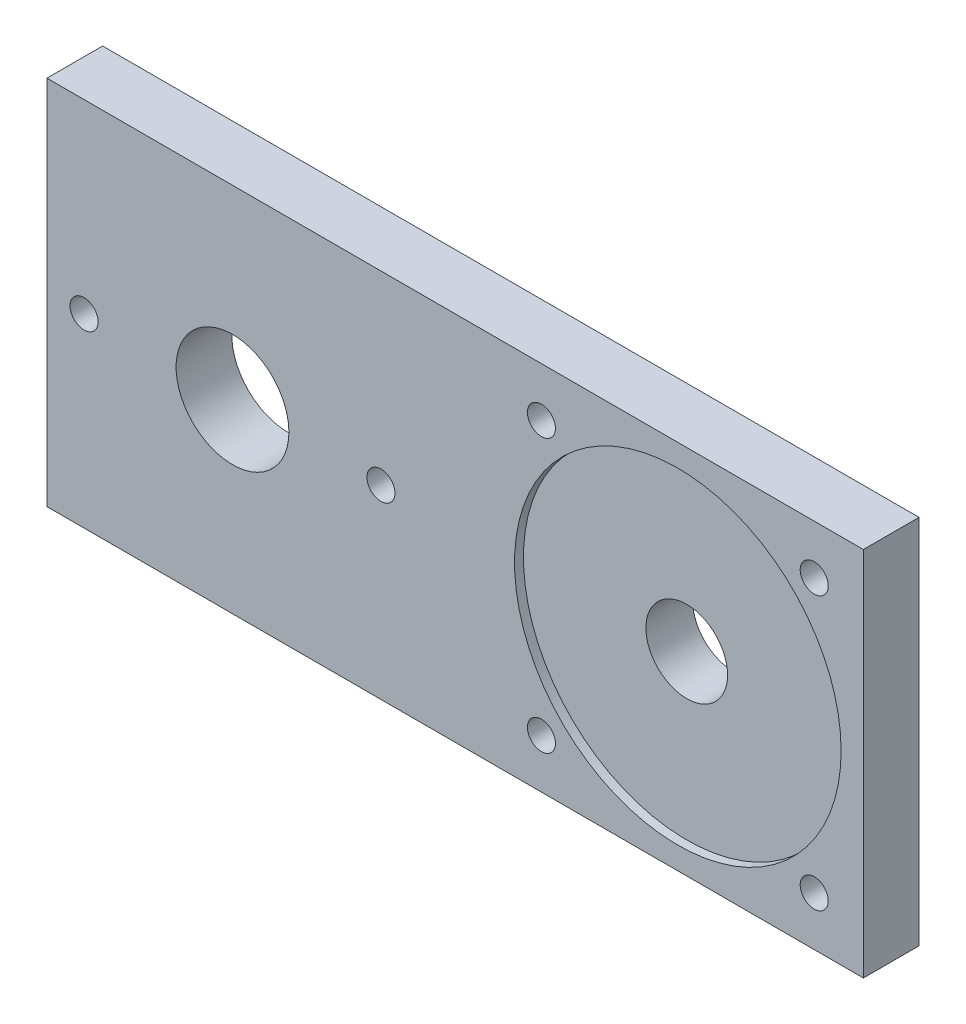
ISO-10303-21;
HEADER;
FILE_DESCRIPTION(('STEP AP214'),'2;1');
FILE_NAME('part.step','',(''),(''),'','','');
FILE_SCHEMA(('AUTOMOTIVE_DESIGN { 1 0 10303 214 1 1 1 1 }'));
ENDSEC;
DATA;
#1=APPLICATION_CONTEXT('core data for automotive mechanical design processes');
#2=APPLICATION_PROTOCOL_DEFINITION('international standard','automotive_design',2000,#1);
#3=PRODUCT_CONTEXT('',#1,'mechanical');
#4=PRODUCT('Part','Part','',(#3));
#5=PRODUCT_RELATED_PRODUCT_CATEGORY('part','',(#4));
#6=PRODUCT_DEFINITION_FORMATION('','',#4);
#7=PRODUCT_DEFINITION_CONTEXT('part definition',#1,'design');
#8=PRODUCT_DEFINITION('design','',#6,#7);
#9=PRODUCT_DEFINITION_SHAPE('','',#8);
#10=(LENGTH_UNIT() NAMED_UNIT(*) SI_UNIT(.MILLI.,.METRE.));
#11=(NAMED_UNIT(*) PLANE_ANGLE_UNIT() SI_UNIT($,.RADIAN.));
#12=(NAMED_UNIT(*) SI_UNIT($,.STERADIAN.) SOLID_ANGLE_UNIT());
#13=UNCERTAINTY_MEASURE_WITH_UNIT(LENGTH_MEASURE(1.E-05),#10,'distance_accuracy_value','');
#14=(GEOMETRIC_REPRESENTATION_CONTEXT(3) GLOBAL_UNCERTAINTY_ASSIGNED_CONTEXT((#13)) GLOBAL_UNIT_ASSIGNED_CONTEXT((#10,
#11,#12)) REPRESENTATION_CONTEXT('',''));
#15=CARTESIAN_POINT('',(0.,0.,0.));
#16=DIRECTION('',(0.,0.,1.));
#17=DIRECTION('',(1.,0.,0.));
#18=AXIS2_PLACEMENT_3D('',#15,#16,#17);
#19=CARTESIAN_POINT('',(0.,0.,9.525));
#20=DIRECTION('',(0.,0.,-1.));
#21=DIRECTION('',(-1.,0.,0.));
#22=AXIS2_PLACEMENT_3D('',#19,#20,#21);
#23=PLANE('',#22);
#24=CARTESIAN_POINT('',(38.1,38.1,9.525));
#25=DIRECTION('',(0.,0.,1.));
#26=DIRECTION('',(1.,0.,0.));
#27=AXIS2_PLACEMENT_3D('',#24,#25,#26);
#28=CIRCLE('',#27,9.65199999999999);
#29=CARTESIAN_POINT('',(47.752,38.1,9.525));
#30=VERTEX_POINT('',#29);
#31=EDGE_CURVE('E42',#30,#30,#28,.T.);
#32=ORIENTED_EDGE('',*,*,#31,.F.);
#33=EDGE_LOOP('',(#32));
#34=FACE_BOUND('',#33,.T.);
#35=CARTESIAN_POINT('',(12.7,38.1,9.525));
#36=DIRECTION('',(0.,0.,1.));
#37=DIRECTION('',(1.,0.,0.));
#38=AXIS2_PLACEMENT_3D('',#35,#36,#37);
#39=CIRCLE('',#38,2.40029999999999);
#40=CARTESIAN_POINT('',(15.1003,38.1,9.525));
#41=VERTEX_POINT('',#40);
#42=EDGE_CURVE('E146',#41,#41,#39,.T.);
#43=ORIENTED_EDGE('',*,*,#42,.F.);
#44=EDGE_LOOP('',(#43));
#45=FACE_BOUND('',#44,.T.);
#46=CARTESIAN_POINT('',(63.5,38.1,9.525));
#47=DIRECTION('',(0.,0.,1.));
#48=DIRECTION('',(1.,0.,0.));
#49=AXIS2_PLACEMENT_3D('',#46,#47,#48);
#50=CIRCLE('',#49,2.40029999999999);
#51=CARTESIAN_POINT('',(65.9003,38.1,9.525));
#52=VERTEX_POINT('',#51);
#53=EDGE_CURVE('E118',#52,#52,#50,.T.);
#54=ORIENTED_EDGE('',*,*,#53,.F.);
#55=EDGE_LOOP('',(#54));
#56=FACE_BOUND('',#55,.T.);
#57=CARTESIAN_POINT('',(90.95994,61.44006,9.525));
#58=DIRECTION('',(0.,0.,1.));
#59=DIRECTION('',(1.,0.,0.));
#60=AXIS2_PLACEMENT_3D('',#57,#58,#59);
#61=CIRCLE('',#60,2.40029999999999);
#62=CARTESIAN_POINT('',(93.36024,61.44006,9.525));
#63=VERTEX_POINT('',#62);
#64=EDGE_CURVE('E119',#63,#63,#61,.T.);
#65=ORIENTED_EDGE('',*,*,#64,.F.);
#66=EDGE_LOOP('',(#65));
#67=FACE_BOUND('',#66,.T.);
#68=CARTESIAN_POINT('',(137.64006,61.44006,9.525));
#69=DIRECTION('',(0.,0.,1.));
#70=DIRECTION('',(1.,0.,0.));
#71=AXIS2_PLACEMENT_3D('',#68,#69,#70);
#72=CIRCLE('',#71,2.40029999999999);
#73=CARTESIAN_POINT('',(140.04036,61.44006,9.525));
#74=VERTEX_POINT('',#73);
#75=EDGE_CURVE('E125',#74,#74,#72,.T.);
#76=ORIENTED_EDGE('',*,*,#75,.F.);
#77=EDGE_LOOP('',(#76));
#78=FACE_BOUND('',#77,.T.);
#79=CARTESIAN_POINT('',(90.95994,14.75994,9.525));
#80=DIRECTION('',(0.,0.,1.));
#81=DIRECTION('',(1.,0.,0.));
#82=AXIS2_PLACEMENT_3D('',#79,#80,#81);
#83=CIRCLE('',#82,2.40029999999999);
#84=CARTESIAN_POINT('',(93.36024,14.75994,9.525));
#85=VERTEX_POINT('',#84);
#86=EDGE_CURVE('E131',#85,#85,#83,.T.);
#87=ORIENTED_EDGE('',*,*,#86,.F.);
#88=EDGE_LOOP('',(#87));
#89=FACE_BOUND('',#88,.T.);
#90=CARTESIAN_POINT('',(137.64006,14.75994,9.525));
#91=DIRECTION('',(0.,0.,1.));
#92=DIRECTION('',(1.,0.,0.));
#93=AXIS2_PLACEMENT_3D('',#90,#91,#92);
#94=CIRCLE('',#93,2.40029999999999);
#95=CARTESIAN_POINT('',(140.04036,14.75994,9.525));
#96=VERTEX_POINT('',#95);
#97=EDGE_CURVE('E137',#96,#96,#94,.T.);
#98=ORIENTED_EDGE('',*,*,#97,.F.);
#99=EDGE_LOOP('',(#98));
#100=FACE_BOUND('',#99,.T.);
#101=CARTESIAN_POINT('',(114.3,38.1,9.525));
#102=DIRECTION('',(0.,0.,1.));
#103=DIRECTION('',(1.,0.,0.));
#104=AXIS2_PLACEMENT_3D('',#101,#102,#103);
#105=CIRCLE('',#104,27.94);
#106=CARTESIAN_POINT('',(142.24,38.1,9.525));
#107=VERTEX_POINT('',#106);
#108=EDGE_CURVE('E107',#107,#107,#105,.T.);
#109=ORIENTED_EDGE('',*,*,#108,.F.);
#110=EDGE_LOOP('',(#109));
#111=FACE_BOUND('',#110,.T.);
#112=DIRECTION('',(1.,0.,0.));
#113=VECTOR('',#112,1.);
#114=CARTESIAN_POINT('',(146.05,69.85,9.525));
#115=LINE('',#114,#113);
#116=CARTESIAN_POINT('',(6.34999999999999,69.85,9.525));
#117=VERTEX_POINT('',#116);
#118=CARTESIAN_POINT('',(146.05,69.85,9.525));
#119=VERTEX_POINT('',#118);
#120=EDGE_CURVE('E50',#117,#119,#115,.T.);
#121=ORIENTED_EDGE('',*,*,#120,.F.);
#122=DIRECTION('',(0.,1.,0.));
#123=VECTOR('',#122,1.);
#124=CARTESIAN_POINT('',(6.34999999999999,69.85,9.525));
#125=LINE('',#124,#123);
#126=CARTESIAN_POINT('',(6.35,6.34999999999999,9.525));
#127=VERTEX_POINT('',#126);
#128=EDGE_CURVE('E80',#127,#117,#125,.T.);
#129=ORIENTED_EDGE('',*,*,#128,.F.);
#130=DIRECTION('',(-1.,0.,0.));
#131=VECTOR('',#130,1.);
#132=CARTESIAN_POINT('',(146.05,6.35,9.525));
#133=LINE('',#132,#131);
#134=CARTESIAN_POINT('',(146.05,6.35,9.525));
#135=VERTEX_POINT('',#134);
#136=EDGE_CURVE('E87',#135,#127,#133,.T.);
#137=ORIENTED_EDGE('',*,*,#136,.F.);
#138=DIRECTION('',(0.,-1.,0.));
#139=VECTOR('',#138,1.);
#140=CARTESIAN_POINT('',(146.05,69.85,9.525));
#141=LINE('',#140,#139);
#142=EDGE_CURVE('E92',#119,#135,#141,.T.);
#143=ORIENTED_EDGE('',*,*,#142,.F.);
#144=EDGE_LOOP('',(#121,#129,#137,#143));
#145=FACE_BOUND('',#144,.T.);
#146=ADVANCED_FACE('F33',(#34,#45,#56,#67,#78,#89,#100,#111,#145),#23,.F.);
#147=CARTESIAN_POINT('',(0.,0.,0.));
#148=DIRECTION('',(0.,0.,-1.));
#149=DIRECTION('',(-1.,0.,0.));
#150=AXIS2_PLACEMENT_3D('',#147,#148,#149);
#151=PLANE('',#150);
#152=CARTESIAN_POINT('',(38.1,38.1,0.));
#153=DIRECTION('',(0.,0.,1.));
#154=DIRECTION('',(1.,0.,0.));
#155=AXIS2_PLACEMENT_3D('',#152,#153,#154);
#156=CIRCLE('',#155,9.65199999999999);
#157=CARTESIAN_POINT('',(47.752,38.1,0.));
#158=VERTEX_POINT('',#157);
#159=EDGE_CURVE('E11',#158,#158,#156,.T.);
#160=ORIENTED_EDGE('',*,*,#159,.T.);
#161=EDGE_LOOP('',(#160));
#162=FACE_BOUND('',#161,.T.);
#163=CARTESIAN_POINT('',(114.3,38.1,0.));
#164=DIRECTION('',(0.,0.,1.));
#165=DIRECTION('',(1.,0.,0.));
#166=AXIS2_PLACEMENT_3D('',#163,#164,#165);
#167=CIRCLE('',#166,6.98500000000001);
#168=CARTESIAN_POINT('',(121.285,38.1,0.));
#169=VERTEX_POINT('',#168);
#170=EDGE_CURVE('E140',#169,#169,#167,.T.);
#171=ORIENTED_EDGE('',*,*,#170,.T.);
#172=EDGE_LOOP('',(#171));
#173=FACE_BOUND('',#172,.T.);
#174=CARTESIAN_POINT('',(12.7,38.1,0.));
#175=DIRECTION('',(0.,0.,1.));
#176=DIRECTION('',(1.,0.,0.));
#177=AXIS2_PLACEMENT_3D('',#174,#175,#176);
#178=CIRCLE('',#177,2.40029999999999);
#179=CARTESIAN_POINT('',(15.1003,38.1,0.));
#180=VERTEX_POINT('',#179);
#181=EDGE_CURVE('E143',#180,#180,#178,.T.);
#182=ORIENTED_EDGE('',*,*,#181,.T.);
#183=EDGE_LOOP('',(#182));
#184=FACE_BOUND('',#183,.T.);
#185=CARTESIAN_POINT('',(63.5,38.1,0.));
#186=DIRECTION('',(0.,0.,1.));
#187=DIRECTION('',(1.,0.,0.));
#188=AXIS2_PLACEMENT_3D('',#185,#186,#187);
#189=CIRCLE('',#188,2.40029999999999);
#190=CARTESIAN_POINT('',(65.9003,38.1,0.));
#191=VERTEX_POINT('',#190);
#192=EDGE_CURVE('E149',#191,#191,#189,.T.);
#193=ORIENTED_EDGE('',*,*,#192,.T.);
#194=EDGE_LOOP('',(#193));
#195=FACE_BOUND('',#194,.T.);
#196=CARTESIAN_POINT('',(90.95994,61.44006,0.));
#197=DIRECTION('',(0.,0.,1.));
#198=DIRECTION('',(1.,0.,0.));
#199=AXIS2_PLACEMENT_3D('',#196,#197,#198);
#200=CIRCLE('',#199,2.40029999999999);
#201=CARTESIAN_POINT('',(93.36024,61.44006,0.));
#202=VERTEX_POINT('',#201);
#203=EDGE_CURVE('E115',#202,#202,#200,.T.);
#204=ORIENTED_EDGE('',*,*,#203,.T.);
#205=EDGE_LOOP('',(#204));
#206=FACE_BOUND('',#205,.T.);
#207=CARTESIAN_POINT('',(137.64006,61.44006,0.));
#208=DIRECTION('',(0.,0.,1.));
#209=DIRECTION('',(1.,0.,0.));
#210=AXIS2_PLACEMENT_3D('',#207,#208,#209);
#211=CIRCLE('',#210,2.40029999999999);
#212=CARTESIAN_POINT('',(140.04036,61.44006,0.));
#213=VERTEX_POINT('',#212);
#214=EDGE_CURVE('E122',#213,#213,#211,.T.);
#215=ORIENTED_EDGE('',*,*,#214,.T.);
#216=EDGE_LOOP('',(#215));
#217=FACE_BOUND('',#216,.T.);
#218=CARTESIAN_POINT('',(90.95994,14.75994,0.));
#219=DIRECTION('',(0.,0.,1.));
#220=DIRECTION('',(1.,0.,0.));
#221=AXIS2_PLACEMENT_3D('',#218,#219,#220);
#222=CIRCLE('',#221,2.40029999999999);
#223=CARTESIAN_POINT('',(93.36024,14.75994,0.));
#224=VERTEX_POINT('',#223);
#225=EDGE_CURVE('E128',#224,#224,#222,.T.);
#226=ORIENTED_EDGE('',*,*,#225,.T.);
#227=EDGE_LOOP('',(#226));
#228=FACE_BOUND('',#227,.T.);
#229=CARTESIAN_POINT('',(137.64006,14.75994,0.));
#230=DIRECTION('',(0.,0.,1.));
#231=DIRECTION('',(1.,0.,0.));
#232=AXIS2_PLACEMENT_3D('',#229,#230,#231);
#233=CIRCLE('',#232,2.40029999999999);
#234=CARTESIAN_POINT('',(140.04036,14.75994,0.));
#235=VERTEX_POINT('',#234);
#236=EDGE_CURVE('E134',#235,#235,#233,.T.);
#237=ORIENTED_EDGE('',*,*,#236,.T.);
#238=EDGE_LOOP('',(#237));
#239=FACE_BOUND('',#238,.T.);
#240=DIRECTION('',(0.,1.,0.));
#241=VECTOR('',#240,1.);
#242=CARTESIAN_POINT('',(6.34999999999999,69.85,0.));
#243=LINE('',#242,#241);
#244=CARTESIAN_POINT('',(6.35,6.34999999999999,0.));
#245=VERTEX_POINT('',#244);
#246=CARTESIAN_POINT('',(6.34999999999999,69.85,0.));
#247=VERTEX_POINT('',#246);
#248=EDGE_CURVE('E82',#245,#247,#243,.T.);
#249=ORIENTED_EDGE('',*,*,#248,.T.);
#250=DIRECTION('',(1.,0.,0.));
#251=VECTOR('',#250,1.);
#252=CARTESIAN_POINT('',(146.05,69.85,0.));
#253=LINE('',#252,#251);
#254=CARTESIAN_POINT('',(146.05,69.85,0.));
#255=VERTEX_POINT('',#254);
#256=EDGE_CURVE('E99',#247,#255,#253,.T.);
#257=ORIENTED_EDGE('',*,*,#256,.T.);
#258=DIRECTION('',(0.,-1.,0.));
#259=VECTOR('',#258,1.);
#260=CARTESIAN_POINT('',(146.05,69.85,0.));
#261=LINE('',#260,#259);
#262=CARTESIAN_POINT('',(146.05,6.35,0.));
#263=VERTEX_POINT('',#262);
#264=EDGE_CURVE('E102',#255,#263,#261,.T.);
#265=ORIENTED_EDGE('',*,*,#264,.T.);
#266=DIRECTION('',(-1.,0.,0.));
#267=VECTOR('',#266,1.);
#268=CARTESIAN_POINT('',(146.05,6.35,0.));
#269=LINE('',#268,#267);
#270=EDGE_CURVE('E58',#263,#245,#269,.T.);
#271=ORIENTED_EDGE('',*,*,#270,.T.);
#272=EDGE_LOOP('',(#249,#257,#265,#271));
#273=FACE_BOUND('',#272,.T.);
#274=ADVANCED_FACE('F35',(#162,#173,#184,#195,#206,#217,#228,#239,#273),#151,.T.);
#275=CARTESIAN_POINT('',(114.3,38.1,0.));
#276=DIRECTION('',(0.,0.,1.));
#277=DIRECTION('',(1.,0.,0.));
#278=AXIS2_PLACEMENT_3D('',#275,#276,#277);
#279=CYLINDRICAL_SURFACE('',#278,6.98500000000001);
#280=ORIENTED_EDGE('',*,*,#170,.F.);
#281=EDGE_LOOP('',(#280));
#282=FACE_BOUND('',#281,.T.);
#283=CARTESIAN_POINT('',(114.3,38.1,8.001));
#284=DIRECTION('',(0.,0.,1.));
#285=DIRECTION('',(1.,0.,0.));
#286=AXIS2_PLACEMENT_3D('',#283,#284,#285);
#287=CIRCLE('',#286,6.98500000000001);
#288=CARTESIAN_POINT('',(121.285,38.1,8.001));
#289=VERTEX_POINT('',#288);
#290=EDGE_CURVE('E37',#289,#289,#287,.F.);
#291=ORIENTED_EDGE('',*,*,#290,.F.);
#292=EDGE_LOOP('',(#291));
#293=FACE_BOUND('',#292,.T.);
#294=ADVANCED_FACE('F206',(#282,#293),#279,.F.);
#295=CARTESIAN_POINT('',(38.1,38.1,0.));
#296=DIRECTION('',(0.,0.,1.));
#297=DIRECTION('',(1.,0.,0.));
#298=AXIS2_PLACEMENT_3D('',#295,#296,#297);
#299=CYLINDRICAL_SURFACE('',#298,9.65199999999999);
#300=ORIENTED_EDGE('',*,*,#159,.F.);
#301=EDGE_LOOP('',(#300));
#302=FACE_BOUND('',#301,.T.);
#303=ORIENTED_EDGE('',*,*,#31,.T.);
#304=EDGE_LOOP('',(#303));
#305=FACE_BOUND('',#304,.T.);
#306=ADVANCED_FACE('F156',(#302,#305),#299,.F.);
#307=CARTESIAN_POINT('',(12.7,38.1,0.));
#308=DIRECTION('',(0.,0.,1.));
#309=DIRECTION('',(1.,0.,0.));
#310=AXIS2_PLACEMENT_3D('',#307,#308,#309);
#311=CYLINDRICAL_SURFACE('',#310,2.40029999999999);
#312=ORIENTED_EDGE('',*,*,#181,.F.);
#313=EDGE_LOOP('',(#312));
#314=FACE_BOUND('',#313,.T.);
#315=ORIENTED_EDGE('',*,*,#42,.T.);
#316=EDGE_LOOP('',(#315));
#317=FACE_BOUND('',#316,.T.);
#318=ADVANCED_FACE('F210',(#314,#317),#311,.F.);
#319=CARTESIAN_POINT('',(63.5,38.1,0.));
#320=DIRECTION('',(0.,0.,1.));
#321=DIRECTION('',(1.,0.,0.));
#322=AXIS2_PLACEMENT_3D('',#319,#320,#321);
#323=CYLINDRICAL_SURFACE('',#322,2.40029999999999);
#324=ORIENTED_EDGE('',*,*,#192,.F.);
#325=EDGE_LOOP('',(#324));
#326=FACE_BOUND('',#325,.T.);
#327=ORIENTED_EDGE('',*,*,#53,.T.);
#328=EDGE_LOOP('',(#327));
#329=FACE_BOUND('',#328,.T.);
#330=ADVANCED_FACE('F194',(#326,#329),#323,.F.);
#331=CARTESIAN_POINT('',(90.95994,61.44006,0.));
#332=DIRECTION('',(0.,0.,1.));
#333=DIRECTION('',(1.,0.,0.));
#334=AXIS2_PLACEMENT_3D('',#331,#332,#333);
#335=CYLINDRICAL_SURFACE('',#334,2.40029999999999);
#336=ORIENTED_EDGE('',*,*,#203,.F.);
#337=EDGE_LOOP('',(#336));
#338=FACE_BOUND('',#337,.T.);
#339=ORIENTED_EDGE('',*,*,#64,.T.);
#340=EDGE_LOOP('',(#339));
#341=FACE_BOUND('',#340,.T.);
#342=ADVANCED_FACE('F190',(#338,#341),#335,.F.);
#343=CARTESIAN_POINT('',(137.64006,61.44006,0.));
#344=DIRECTION('',(0.,0.,1.));
#345=DIRECTION('',(1.,0.,0.));
#346=AXIS2_PLACEMENT_3D('',#343,#344,#345);
#347=CYLINDRICAL_SURFACE('',#346,2.40029999999999);
#348=ORIENTED_EDGE('',*,*,#214,.F.);
#349=EDGE_LOOP('',(#348));
#350=FACE_BOUND('',#349,.T.);
#351=ORIENTED_EDGE('',*,*,#75,.T.);
#352=EDGE_LOOP('',(#351));
#353=FACE_BOUND('',#352,.T.);
#354=ADVANCED_FACE('F193',(#350,#353),#347,.F.);
#355=CARTESIAN_POINT('',(90.95994,14.75994,0.));
#356=DIRECTION('',(0.,0.,1.));
#357=DIRECTION('',(1.,0.,0.));
#358=AXIS2_PLACEMENT_3D('',#355,#356,#357);
#359=CYLINDRICAL_SURFACE('',#358,2.40029999999999);
#360=ORIENTED_EDGE('',*,*,#225,.F.);
#361=EDGE_LOOP('',(#360));
#362=FACE_BOUND('',#361,.T.);
#363=ORIENTED_EDGE('',*,*,#86,.T.);
#364=EDGE_LOOP('',(#363));
#365=FACE_BOUND('',#364,.T.);
#366=ADVANCED_FACE('F198',(#362,#365),#359,.F.);
#367=CARTESIAN_POINT('',(137.64006,14.75994,0.));
#368=DIRECTION('',(0.,0.,1.));
#369=DIRECTION('',(1.,0.,0.));
#370=AXIS2_PLACEMENT_3D('',#367,#368,#369);
#371=CYLINDRICAL_SURFACE('',#370,2.40029999999999);
#372=ORIENTED_EDGE('',*,*,#236,.F.);
#373=EDGE_LOOP('',(#372));
#374=FACE_BOUND('',#373,.T.);
#375=ORIENTED_EDGE('',*,*,#97,.T.);
#376=EDGE_LOOP('',(#375));
#377=FACE_BOUND('',#376,.T.);
#378=ADVANCED_FACE('F185',(#374,#377),#371,.F.);
#379=CARTESIAN_POINT('',(114.3,38.1,8.001));
#380=DIRECTION('',(0.,0.,1.));
#381=DIRECTION('',(1.,0.,0.));
#382=AXIS2_PLACEMENT_3D('',#379,#380,#381);
#383=PLANE('',#382);
#384=CARTESIAN_POINT('',(114.3,38.1,8.001));
#385=DIRECTION('',(0.,0.,1.));
#386=DIRECTION('',(1.,0.,0.));
#387=AXIS2_PLACEMENT_3D('',#384,#385,#386);
#388=CIRCLE('',#387,27.94);
#389=CARTESIAN_POINT('',(142.24,38.1,8.001));
#390=VERTEX_POINT('',#389);
#391=EDGE_CURVE('E110',#390,#390,#388,.T.);
#392=ORIENTED_EDGE('',*,*,#391,.T.);
#393=EDGE_LOOP('',(#392));
#394=FACE_BOUND('',#393,.T.);
#395=ORIENTED_EDGE('',*,*,#290,.T.);
#396=EDGE_LOOP('',(#395));
#397=FACE_BOUND('',#396,.T.);
#398=ADVANCED_FACE('F177',(#394,#397),#383,.T.);
#399=CARTESIAN_POINT('',(114.3,38.1,8.001));
#400=DIRECTION('',(0.,0.,1.));
#401=DIRECTION('',(1.,0.,0.));
#402=AXIS2_PLACEMENT_3D('',#399,#400,#401);
#403=CYLINDRICAL_SURFACE('',#402,27.94);
#404=ORIENTED_EDGE('',*,*,#391,.F.);
#405=EDGE_LOOP('',(#404));
#406=FACE_BOUND('',#405,.T.);
#407=ORIENTED_EDGE('',*,*,#108,.T.);
#408=EDGE_LOOP('',(#407));
#409=FACE_BOUND('',#408,.T.);
#410=ADVANCED_FACE('F174',(#406,#409),#403,.F.);
#411=CARTESIAN_POINT('',(146.05,69.85,9.525));
#412=DIRECTION('',(0.,1.,0.));
#413=DIRECTION('',(0.,0.,1.));
#414=AXIS2_PLACEMENT_3D('',#411,#412,#413);
#415=PLANE('',#414);
#416=ORIENTED_EDGE('',*,*,#256,.F.);
#417=DIRECTION('',(0.,0.,-1.));
#418=VECTOR('',#417,1.);
#419=CARTESIAN_POINT('',(6.34999999999999,69.85,9.525));
#420=LINE('',#419,#418);
#421=EDGE_CURVE('E83',#117,#247,#420,.T.);
#422=ORIENTED_EDGE('',*,*,#421,.F.);
#423=ORIENTED_EDGE('',*,*,#120,.T.);
#424=DIRECTION('',(0.,0.,-1.));
#425=VECTOR('',#424,1.);
#426=CARTESIAN_POINT('',(146.05,69.85,9.525));
#427=LINE('',#426,#425);
#428=EDGE_CURVE('E94',#119,#255,#427,.T.);
#429=ORIENTED_EDGE('',*,*,#428,.T.);
#430=EDGE_LOOP('',(#416,#422,#423,#429));
#431=FACE_BOUND('',#430,.T.);
#432=ADVANCED_FACE('F176',(#431),#415,.T.);
#433=CARTESIAN_POINT('',(6.34999999999999,69.85,9.525));
#434=DIRECTION('',(-1.,0.,0.));
#435=DIRECTION('',(0.,-1.,0.));
#436=AXIS2_PLACEMENT_3D('',#433,#434,#435);
#437=PLANE('',#436);
#438=ORIENTED_EDGE('',*,*,#248,.F.);
#439=DIRECTION('',(0.,0.,-1.));
#440=VECTOR('',#439,1.);
#441=CARTESIAN_POINT('',(6.35,6.34999999999999,9.525));
#442=LINE('',#441,#440);
#443=EDGE_CURVE('E76',#127,#245,#442,.T.);
#444=ORIENTED_EDGE('',*,*,#443,.F.);
#445=ORIENTED_EDGE('',*,*,#128,.T.);
#446=ORIENTED_EDGE('',*,*,#421,.T.);
#447=EDGE_LOOP('',(#438,#444,#445,#446));
#448=FACE_BOUND('',#447,.T.);
#449=ADVANCED_FACE('F78',(#448),#437,.T.);
#450=CARTESIAN_POINT('',(146.05,6.35,9.525));
#451=DIRECTION('',(0.,-1.,0.));
#452=DIRECTION('',(1.,0.,0.));
#453=AXIS2_PLACEMENT_3D('',#450,#451,#452);
#454=PLANE('',#453);
#455=ORIENTED_EDGE('',*,*,#270,.F.);
#456=DIRECTION('',(0.,0.,-1.));
#457=VECTOR('',#456,1.);
#458=CARTESIAN_POINT('',(146.05,6.35,9.525));
#459=LINE('',#458,#457);
#460=EDGE_CURVE('E84',#135,#263,#459,.T.);
#461=ORIENTED_EDGE('',*,*,#460,.F.);
#462=ORIENTED_EDGE('',*,*,#136,.T.);
#463=ORIENTED_EDGE('',*,*,#443,.T.);
#464=EDGE_LOOP('',(#455,#461,#462,#463));
#465=FACE_BOUND('',#464,.T.);
#466=ADVANCED_FACE('F88',(#465),#454,.T.);
#467=CARTESIAN_POINT('',(146.05,69.85,9.525));
#468=DIRECTION('',(1.,0.,0.));
#469=DIRECTION('',(0.,0.,-1.));
#470=AXIS2_PLACEMENT_3D('',#467,#468,#469);
#471=PLANE('',#470);
#472=ORIENTED_EDGE('',*,*,#264,.F.);
#473=ORIENTED_EDGE('',*,*,#428,.F.);
#474=ORIENTED_EDGE('',*,*,#142,.T.);
#475=ORIENTED_EDGE('',*,*,#460,.T.);
#476=EDGE_LOOP('',(#472,#473,#474,#475));
#477=FACE_BOUND('',#476,.T.);
#478=ADVANCED_FACE('F242',(#477),#471,.T.);
#479=CLOSED_SHELL('',(#146,#274,#294,#306,#318,#330,#342,#354,#366,#378,#398,#410,#432,#449,
#466,#478));
#480=MANIFOLD_SOLID_BREP('B2',#479);
#481=ADVANCED_BREP_SHAPE_REPRESENTATION('',(#18,#480),#14);
#482=SHAPE_DEFINITION_REPRESENTATION(#9,#481);
ENDSEC;
END-ISO-10303-21;
